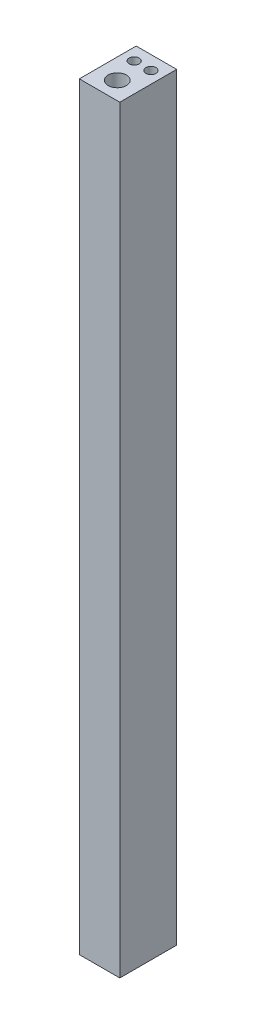
ISO-10303-21;
HEADER;
FILE_DESCRIPTION(('STEP AP214'),'2;1');
FILE_NAME('part.step','',(''),(''),'','','');
FILE_SCHEMA(('AUTOMOTIVE_DESIGN { 1 0 10303 214 1 1 1 1 }'));
ENDSEC;
DATA;
#1=APPLICATION_CONTEXT('core data for automotive mechanical design processes');
#2=APPLICATION_PROTOCOL_DEFINITION('international standard','automotive_design',2000,#1);
#3=PRODUCT_CONTEXT('',#1,'mechanical');
#4=PRODUCT('Part','Part','',(#3));
#5=PRODUCT_RELATED_PRODUCT_CATEGORY('part','',(#4));
#6=PRODUCT_DEFINITION_FORMATION('','',#4);
#7=PRODUCT_DEFINITION_CONTEXT('part definition',#1,'design');
#8=PRODUCT_DEFINITION('design','',#6,#7);
#9=PRODUCT_DEFINITION_SHAPE('','',#8);
#10=(LENGTH_UNIT() NAMED_UNIT(*) SI_UNIT(.MILLI.,.METRE.));
#11=(NAMED_UNIT(*) PLANE_ANGLE_UNIT() SI_UNIT($,.RADIAN.));
#12=(NAMED_UNIT(*) SI_UNIT($,.STERADIAN.) SOLID_ANGLE_UNIT());
#13=UNCERTAINTY_MEASURE_WITH_UNIT(LENGTH_MEASURE(1.E-05),#10,'distance_accuracy_value','');
#14=(GEOMETRIC_REPRESENTATION_CONTEXT(3) GLOBAL_UNCERTAINTY_ASSIGNED_CONTEXT((#13)) GLOBAL_UNIT_ASSIGNED_CONTEXT((#10,
#11,#12)) REPRESENTATION_CONTEXT('',''));
#15=CARTESIAN_POINT('',(0.,0.,0.));
#16=DIRECTION('',(0.,0.,1.));
#17=DIRECTION('',(1.,0.,0.));
#18=AXIS2_PLACEMENT_3D('',#15,#16,#17);
#19=CARTESIAN_POINT('',(1.6,59.999999888,-2.25));
#20=DIRECTION('',(-1.,0.,0.));
#21=DIRECTION('',(0.,0.,1.));
#22=AXIS2_PLACEMENT_3D('',#19,#20,#21);
#23=PLANE('',#22);
#24=DIRECTION('',(0.,0.,-1.));
#25=VECTOR('',#24,1.);
#26=CARTESIAN_POINT('',(1.6,0.,-2.25));
#27=LINE('',#26,#25);
#28=CARTESIAN_POINT('',(1.6,0.,2.25));
#29=VERTEX_POINT('',#28);
#30=CARTESIAN_POINT('',(1.6,0.,-2.25));
#31=VERTEX_POINT('',#30);
#32=EDGE_CURVE('E95',#29,#31,#27,.T.);
#33=ORIENTED_EDGE('',*,*,#32,.T.);
#34=DIRECTION('',(0.,-1.,0.));
#35=VECTOR('',#34,1.);
#36=CARTESIAN_POINT('',(1.6,59.999999888,-2.25));
#37=LINE('',#36,#35);
#38=CARTESIAN_POINT('',(1.6,59.999999888,-2.25));
#39=VERTEX_POINT('',#38);
#40=EDGE_CURVE('E11',#39,#31,#37,.T.);
#41=ORIENTED_EDGE('',*,*,#40,.F.);
#42=DIRECTION('',(0.,0.,-1.));
#43=VECTOR('',#42,1.);
#44=CARTESIAN_POINT('',(1.6,59.999999888,-2.25));
#45=LINE('',#44,#43);
#46=CARTESIAN_POINT('',(1.6,59.999999888,2.25));
#47=VERTEX_POINT('',#46);
#48=EDGE_CURVE('E83',#47,#39,#45,.T.);
#49=ORIENTED_EDGE('',*,*,#48,.F.);
#50=DIRECTION('',(0.,-1.,0.));
#51=VECTOR('',#50,1.);
#52=CARTESIAN_POINT('',(1.6,59.999999888,2.25));
#53=LINE('',#52,#51);
#54=EDGE_CURVE('E91',#47,#29,#53,.T.);
#55=ORIENTED_EDGE('',*,*,#54,.T.);
#56=EDGE_LOOP('',(#33,#41,#49,#55));
#57=FACE_BOUND('',#56,.T.);
#58=ADVANCED_FACE('F32',(#57),#23,.F.);
#59=CARTESIAN_POINT('',(-1.6,59.999999888,-2.25));
#60=DIRECTION('',(0.,0.,1.));
#61=DIRECTION('',(1.,0.,0.));
#62=AXIS2_PLACEMENT_3D('',#59,#60,#61);
#63=PLANE('',#62);
#64=DIRECTION('',(-1.,0.,0.));
#65=VECTOR('',#64,1.);
#66=CARTESIAN_POINT('',(-1.6,0.,-2.25));
#67=LINE('',#66,#65);
#68=CARTESIAN_POINT('',(-1.6,0.,-2.25));
#69=VERTEX_POINT('',#68);
#70=EDGE_CURVE('E87',#31,#69,#67,.T.);
#71=ORIENTED_EDGE('',*,*,#70,.T.);
#72=DIRECTION('',(0.,-1.,0.));
#73=VECTOR('',#72,1.);
#74=CARTESIAN_POINT('',(-1.6,59.999999888,-2.25));
#75=LINE('',#74,#73);
#76=CARTESIAN_POINT('',(-1.6,59.999999888,-2.25));
#77=VERTEX_POINT('',#76);
#78=EDGE_CURVE('E40',#77,#69,#75,.T.);
#79=ORIENTED_EDGE('',*,*,#78,.F.);
#80=DIRECTION('',(-1.,0.,0.));
#81=VECTOR('',#80,1.);
#82=CARTESIAN_POINT('',(-1.6,59.999999888,-2.25));
#83=LINE('',#82,#81);
#84=EDGE_CURVE('E78',#39,#77,#83,.T.);
#85=ORIENTED_EDGE('',*,*,#84,.F.);
#86=ORIENTED_EDGE('',*,*,#40,.T.);
#87=EDGE_LOOP('',(#71,#79,#85,#86));
#88=FACE_BOUND('',#87,.T.);
#89=ADVANCED_FACE('F86',(#88),#63,.F.);
#90=CARTESIAN_POINT('',(-1.6,59.999999888,-2.25));
#91=DIRECTION('',(1.,0.,0.));
#92=DIRECTION('',(0.,0.,-1.));
#93=AXIS2_PLACEMENT_3D('',#90,#91,#92);
#94=PLANE('',#93);
#95=DIRECTION('',(0.,0.,1.));
#96=VECTOR('',#95,1.);
#97=CARTESIAN_POINT('',(-1.6,0.,-2.25));
#98=LINE('',#97,#96);
#99=CARTESIAN_POINT('',(-1.6,0.,2.25));
#100=VERTEX_POINT('',#99);
#101=EDGE_CURVE('E65',#69,#100,#98,.T.);
#102=ORIENTED_EDGE('',*,*,#101,.T.);
#103=DIRECTION('',(0.,-1.,0.));
#104=VECTOR('',#103,1.);
#105=CARTESIAN_POINT('',(-1.6,59.999999888,2.25));
#106=LINE('',#105,#104);
#107=CARTESIAN_POINT('',(-1.6,59.999999888,2.25));
#108=VERTEX_POINT('',#107);
#109=EDGE_CURVE('E88',#108,#100,#106,.T.);
#110=ORIENTED_EDGE('',*,*,#109,.F.);
#111=DIRECTION('',(0.,0.,1.));
#112=VECTOR('',#111,1.);
#113=CARTESIAN_POINT('',(-1.6,59.999999888,-2.25));
#114=LINE('',#113,#112);
#115=EDGE_CURVE('E81',#77,#108,#114,.T.);
#116=ORIENTED_EDGE('',*,*,#115,.F.);
#117=ORIENTED_EDGE('',*,*,#78,.T.);
#118=EDGE_LOOP('',(#102,#110,#116,#117));
#119=FACE_BOUND('',#118,.T.);
#120=ADVANCED_FACE('F89',(#119),#94,.F.);
#121=CARTESIAN_POINT('',(-1.6,59.999999888,2.25));
#122=DIRECTION('',(0.,0.,-1.));
#123=DIRECTION('',(-1.,0.,0.));
#124=AXIS2_PLACEMENT_3D('',#121,#122,#123);
#125=PLANE('',#124);
#126=DIRECTION('',(1.,0.,0.));
#127=VECTOR('',#126,1.);
#128=CARTESIAN_POINT('',(-1.6,0.,2.25));
#129=LINE('',#128,#127);
#130=EDGE_CURVE('E71',#100,#29,#129,.T.);
#131=ORIENTED_EDGE('',*,*,#130,.T.);
#132=ORIENTED_EDGE('',*,*,#54,.F.);
#133=DIRECTION('',(1.,0.,0.));
#134=VECTOR('',#133,1.);
#135=CARTESIAN_POINT('',(-1.6,59.999999888,2.25));
#136=LINE('',#135,#134);
#137=EDGE_CURVE('E48',#108,#47,#136,.T.);
#138=ORIENTED_EDGE('',*,*,#137,.F.);
#139=ORIENTED_EDGE('',*,*,#109,.T.);
#140=EDGE_LOOP('',(#131,#132,#138,#139));
#141=FACE_BOUND('',#140,.T.);
#142=ADVANCED_FACE('F103',(#141),#125,.F.);
#143=CARTESIAN_POINT('',(1.6,59.999999888,2.25));
#144=DIRECTION('',(0.,1.,0.));
#145=DIRECTION('',(0.,0.,1.));
#146=AXIS2_PLACEMENT_3D('',#143,#144,#145);
#147=PLANE('',#146);
#148=CARTESIAN_POINT('',(0.657995536119054,59.999999888,-1.15332184418465));
#149=DIRECTION('',(0.,1.,0.));
#150=DIRECTION('',(0.,0.,1.));
#151=AXIS2_PLACEMENT_3D('',#148,#149,#150);
#152=CIRCLE('',#151,0.4);
#153=CARTESIAN_POINT('',(0.657995536119054,59.999999888,-0.753321844184649));
#154=VERTEX_POINT('',#153);
#155=EDGE_CURVE('E121',#154,#154,#152,.T.);
#156=ORIENTED_EDGE('',*,*,#155,.F.);
#157=EDGE_LOOP('',(#156));
#158=FACE_BOUND('',#157,.T.);
#159=CARTESIAN_POINT('',(-0.656880529215797,59.999999888,-1.14505640249144));
#160=DIRECTION('',(0.,1.,0.));
#161=DIRECTION('',(0.,0.,1.));
#162=AXIS2_PLACEMENT_3D('',#159,#160,#161);
#163=CIRCLE('',#162,0.399999961999999);
#164=CARTESIAN_POINT('',(-0.656880529215797,59.999999888,-0.745056440491438));
#165=VERTEX_POINT('',#164);
#166=EDGE_CURVE('E115',#165,#165,#163,.T.);
#167=ORIENTED_EDGE('',*,*,#166,.F.);
#168=EDGE_LOOP('',(#167));
#169=FACE_BOUND('',#168,.T.);
#170=CARTESIAN_POINT('',(0.,59.999999888,0.849563353336017));
#171=DIRECTION('',(0.,1.,0.));
#172=DIRECTION('',(0.,0.,1.));
#173=AXIS2_PLACEMENT_3D('',#170,#171,#172);
#174=CIRCLE('',#173,0.724999947);
#175=CARTESIAN_POINT('',(0.,59.999999888,1.57456330033602));
#176=VERTEX_POINT('',#175);
#177=EDGE_CURVE('E109',#176,#176,#174,.T.);
#178=ORIENTED_EDGE('',*,*,#177,.F.);
#179=EDGE_LOOP('',(#178));
#180=FACE_BOUND('',#179,.T.);
#181=ORIENTED_EDGE('',*,*,#48,.T.);
#182=ORIENTED_EDGE('',*,*,#84,.T.);
#183=ORIENTED_EDGE('',*,*,#115,.T.);
#184=ORIENTED_EDGE('',*,*,#137,.T.);
#185=EDGE_LOOP('',(#181,#182,#183,#184));
#186=FACE_BOUND('',#185,.T.);
#187=ADVANCED_FACE('F79',(#158,#169,#180,#186),#147,.T.);
#188=CARTESIAN_POINT('',(1.6,0.,2.25));
#189=DIRECTION('',(0.,1.,0.));
#190=DIRECTION('',(0.,0.,1.));
#191=AXIS2_PLACEMENT_3D('',#188,#189,#190);
#192=PLANE('',#191);
#193=CARTESIAN_POINT('',(0.657995536119054,0.,-1.15332184418465));
#194=DIRECTION('',(0.,1.,0.));
#195=DIRECTION('',(0.,0.,1.));
#196=AXIS2_PLACEMENT_3D('',#193,#194,#195);
#197=CIRCLE('',#196,0.4);
#198=CARTESIAN_POINT('',(0.657995536119054,0.,-0.753321844184649));
#199=VERTEX_POINT('',#198);
#200=EDGE_CURVE('E118',#199,#199,#197,.T.);
#201=ORIENTED_EDGE('',*,*,#200,.T.);
#202=EDGE_LOOP('',(#201));
#203=FACE_BOUND('',#202,.T.);
#204=CARTESIAN_POINT('',(-0.656880529215797,0.,-1.14505640249144));
#205=DIRECTION('',(0.,1.,0.));
#206=DIRECTION('',(0.,0.,1.));
#207=AXIS2_PLACEMENT_3D('',#204,#205,#206);
#208=CIRCLE('',#207,0.399999961999999);
#209=CARTESIAN_POINT('',(-0.656880529215797,0.,-0.745056440491438));
#210=VERTEX_POINT('',#209);
#211=EDGE_CURVE('E112',#210,#210,#208,.T.);
#212=ORIENTED_EDGE('',*,*,#211,.T.);
#213=EDGE_LOOP('',(#212));
#214=FACE_BOUND('',#213,.T.);
#215=CARTESIAN_POINT('',(0.,0.,0.849563353336017));
#216=DIRECTION('',(0.,1.,0.));
#217=DIRECTION('',(0.,0.,1.));
#218=AXIS2_PLACEMENT_3D('',#215,#216,#217);
#219=CIRCLE('',#218,0.724999947);
#220=CARTESIAN_POINT('',(0.,0.,1.57456330033602));
#221=VERTEX_POINT('',#220);
#222=EDGE_CURVE('E98',#221,#221,#219,.T.);
#223=ORIENTED_EDGE('',*,*,#222,.T.);
#224=EDGE_LOOP('',(#223));
#225=FACE_BOUND('',#224,.T.);
#226=ORIENTED_EDGE('',*,*,#32,.F.);
#227=ORIENTED_EDGE('',*,*,#130,.F.);
#228=ORIENTED_EDGE('',*,*,#101,.F.);
#229=ORIENTED_EDGE('',*,*,#70,.F.);
#230=EDGE_LOOP('',(#226,#227,#228,#229));
#231=FACE_BOUND('',#230,.T.);
#232=ADVANCED_FACE('F106',(#203,#214,#225,#231),#192,.F.);
#233=CARTESIAN_POINT('',(0.,0.,0.849563353336017));
#234=DIRECTION('',(0.,1.,0.));
#235=DIRECTION('',(0.,0.,1.));
#236=AXIS2_PLACEMENT_3D('',#233,#234,#235);
#237=CYLINDRICAL_SURFACE('',#236,0.724999947);
#238=ORIENTED_EDGE('',*,*,#222,.F.);
#239=EDGE_LOOP('',(#238));
#240=FACE_BOUND('',#239,.T.);
#241=ORIENTED_EDGE('',*,*,#177,.T.);
#242=EDGE_LOOP('',(#241));
#243=FACE_BOUND('',#242,.T.);
#244=ADVANCED_FACE('F143',(#240,#243),#237,.F.);
#245=CARTESIAN_POINT('',(-0.656880529215797,0.,-1.14505640249144));
#246=DIRECTION('',(0.,1.,0.));
#247=DIRECTION('',(0.,0.,1.));
#248=AXIS2_PLACEMENT_3D('',#245,#246,#247);
#249=CYLINDRICAL_SURFACE('',#248,0.399999961999999);
#250=ORIENTED_EDGE('',*,*,#211,.F.);
#251=EDGE_LOOP('',(#250));
#252=FACE_BOUND('',#251,.T.);
#253=ORIENTED_EDGE('',*,*,#166,.T.);
#254=EDGE_LOOP('',(#253));
#255=FACE_BOUND('',#254,.T.);
#256=ADVANCED_FACE('F132',(#252,#255),#249,.F.);
#257=CARTESIAN_POINT('',(0.657995536119054,0.,-1.15332184418465));
#258=DIRECTION('',(0.,1.,0.));
#259=DIRECTION('',(0.,0.,1.));
#260=AXIS2_PLACEMENT_3D('',#257,#258,#259);
#261=CYLINDRICAL_SURFACE('',#260,0.4);
#262=ORIENTED_EDGE('',*,*,#200,.F.);
#263=EDGE_LOOP('',(#262));
#264=FACE_BOUND('',#263,.T.);
#265=ORIENTED_EDGE('',*,*,#155,.T.);
#266=EDGE_LOOP('',(#265));
#267=FACE_BOUND('',#266,.T.);
#268=ADVANCED_FACE('F129',(#264,#267),#261,.F.);
#269=CLOSED_SHELL('',(#58,#89,#120,#142,#187,#232,#244,#256,#268));
#270=MANIFOLD_SOLID_BREP('B2',#269);
#271=ADVANCED_BREP_SHAPE_REPRESENTATION('',(#18,#270),#14);
#272=SHAPE_DEFINITION_REPRESENTATION(#9,#271);
ENDSEC;
END-ISO-10303-21;
